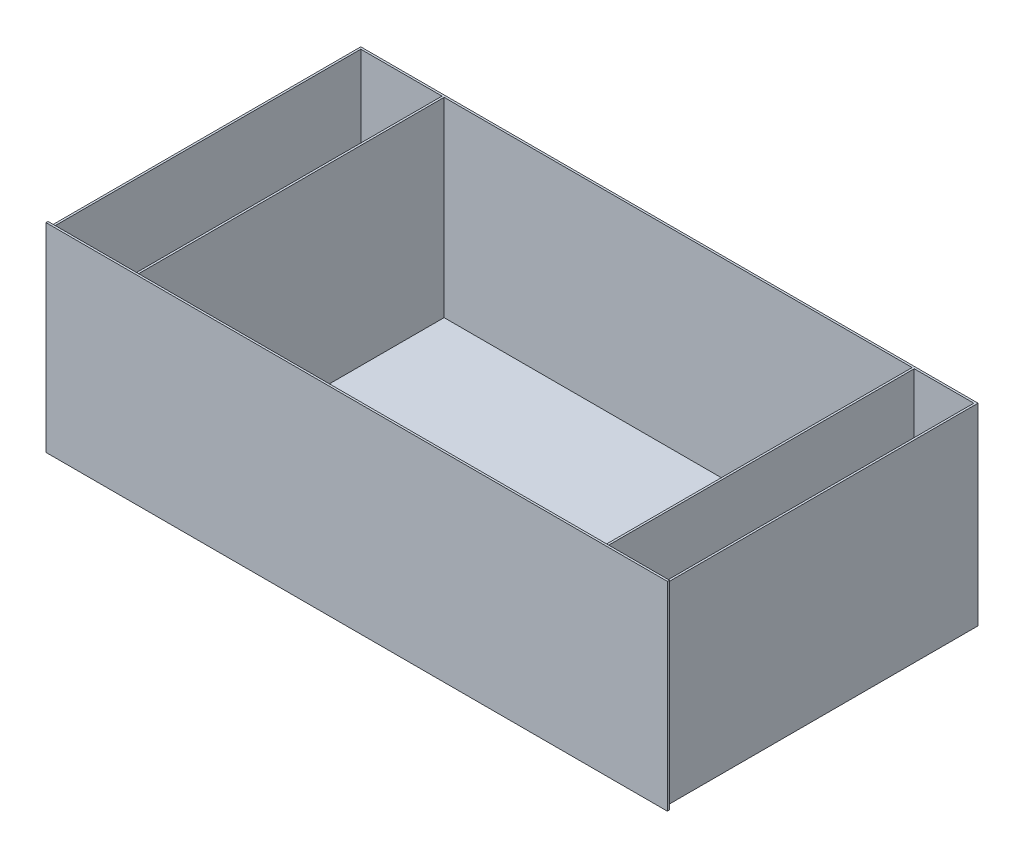
ISO-10303-21;
HEADER;
FILE_DESCRIPTION(('STEP AP214'),'2;1');
FILE_NAME('part.step','',(''),(''),'','','');
FILE_SCHEMA(('AUTOMOTIVE_DESIGN { 1 0 10303 214 1 1 1 1 }'));
ENDSEC;
DATA;
#1=APPLICATION_CONTEXT('core data for automotive mechanical design processes');
#2=APPLICATION_PROTOCOL_DEFINITION('international standard','automotive_design',2000,#1);
#3=PRODUCT_CONTEXT('',#1,'mechanical');
#4=PRODUCT('Part','Part','',(#3));
#5=PRODUCT_RELATED_PRODUCT_CATEGORY('part','',(#4));
#6=PRODUCT_DEFINITION_FORMATION('','',#4);
#7=PRODUCT_DEFINITION_CONTEXT('part definition',#1,'design');
#8=PRODUCT_DEFINITION('design','',#6,#7);
#9=PRODUCT_DEFINITION_SHAPE('','',#8);
#10=(LENGTH_UNIT() NAMED_UNIT(*) SI_UNIT(.MILLI.,.METRE.));
#11=(NAMED_UNIT(*) PLANE_ANGLE_UNIT() SI_UNIT($,.RADIAN.));
#12=(NAMED_UNIT(*) SI_UNIT($,.STERADIAN.) SOLID_ANGLE_UNIT());
#13=UNCERTAINTY_MEASURE_WITH_UNIT(LENGTH_MEASURE(1.E-05),#10,'distance_accuracy_value','');
#14=(GEOMETRIC_REPRESENTATION_CONTEXT(3) GLOBAL_UNCERTAINTY_ASSIGNED_CONTEXT((#13)) GLOBAL_UNIT_ASSIGNED_CONTEXT((#10,
#11,#12)) REPRESENTATION_CONTEXT('',''));
#15=CARTESIAN_POINT('',(0.,0.,0.));
#16=DIRECTION('',(0.,0.,1.));
#17=DIRECTION('',(1.,0.,0.));
#18=AXIS2_PLACEMENT_3D('',#15,#16,#17);
#19=CARTESIAN_POINT('',(604.,193.5,4.));
#20=DIRECTION('',(-1.,0.,0.));
#21=DIRECTION('',(0.,-1.,0.));
#22=AXIS2_PLACEMENT_3D('',#19,#20,#21);
#23=PLANE('',#22);
#24=DIRECTION('',(0.,1.,0.));
#25=VECTOR('',#24,1.);
#26=CARTESIAN_POINT('',(604.,193.5,0.));
#27=LINE('',#26,#25);
#28=CARTESIAN_POINT('',(604.,-193.5,0.));
#29=VERTEX_POINT('',#28);
#30=CARTESIAN_POINT('',(604.,193.5,0.));
#31=VERTEX_POINT('',#30);
#32=EDGE_CURVE('E303',#29,#31,#27,.T.);
#33=ORIENTED_EDGE('',*,*,#32,.T.);
#34=DIRECTION('',(0.,0.,-1.));
#35=VECTOR('',#34,1.);
#36=CARTESIAN_POINT('',(604.,193.5,4.));
#37=LINE('',#36,#35);
#38=CARTESIAN_POINT('',(604.,193.5,4.));
#39=VERTEX_POINT('',#38);
#40=EDGE_CURVE('E11',#39,#31,#37,.T.);
#41=ORIENTED_EDGE('',*,*,#40,.F.);
#42=DIRECTION('',(0.,1.,0.));
#43=VECTOR('',#42,1.);
#44=CARTESIAN_POINT('',(604.,193.5,4.));
#45=LINE('',#44,#43);
#46=CARTESIAN_POINT('',(604.,-193.5,4.));
#47=VERTEX_POINT('',#46);
#48=EDGE_CURVE('E304',#47,#39,#45,.T.);
#49=ORIENTED_EDGE('',*,*,#48,.F.);
#50=DIRECTION('',(0.,0.,-1.));
#51=VECTOR('',#50,1.);
#52=CARTESIAN_POINT('',(604.,-193.5,4.));
#53=LINE('',#52,#51);
#54=EDGE_CURVE('E314',#47,#29,#53,.T.);
#55=ORIENTED_EDGE('',*,*,#54,.T.);
#56=EDGE_LOOP('',(#33,#41,#49,#55));
#57=FACE_BOUND('',#56,.T.);
#58=ADVANCED_FACE('F36',(#57),#23,.F.);
#59=CARTESIAN_POINT('',(-604.,193.5,4.));
#60=DIRECTION('',(0.,-1.,0.));
#61=DIRECTION('',(0.,0.,-1.));
#62=AXIS2_PLACEMENT_3D('',#59,#60,#61);
#63=PLANE('',#62);
#64=DIRECTION('',(-1.,0.,0.));
#65=VECTOR('',#64,1.);
#66=CARTESIAN_POINT('',(-604.,193.5,0.));
#67=LINE('',#66,#65);
#68=CARTESIAN_POINT('',(-604.,193.5,0.));
#69=VERTEX_POINT('',#68);
#70=EDGE_CURVE('E317',#31,#69,#67,.T.);
#71=ORIENTED_EDGE('',*,*,#70,.T.);
#72=DIRECTION('',(0.,0.,-1.));
#73=VECTOR('',#72,1.);
#74=CARTESIAN_POINT('',(-604.,193.5,4.));
#75=LINE('',#74,#73);
#76=CARTESIAN_POINT('',(-604.,193.5,4.));
#77=VERTEX_POINT('',#76);
#78=EDGE_CURVE('E43',#77,#69,#75,.T.);
#79=ORIENTED_EDGE('',*,*,#78,.F.);
#80=DIRECTION('',(-1.,0.,0.));
#81=VECTOR('',#80,1.);
#82=CARTESIAN_POINT('',(-604.,193.5,4.));
#83=LINE('',#82,#81);
#84=EDGE_CURVE('E307',#39,#77,#83,.T.);
#85=ORIENTED_EDGE('',*,*,#84,.F.);
#86=ORIENTED_EDGE('',*,*,#40,.T.);
#87=EDGE_LOOP('',(#71,#79,#85,#86));
#88=FACE_BOUND('',#87,.T.);
#89=ADVANCED_FACE('F347',(#88),#63,.F.);
#90=CARTESIAN_POINT('',(-604.,193.5,4.));
#91=DIRECTION('',(1.,0.,0.));
#92=DIRECTION('',(0.,1.,0.));
#93=AXIS2_PLACEMENT_3D('',#90,#91,#92);
#94=PLANE('',#93);
#95=DIRECTION('',(0.,-1.,0.));
#96=VECTOR('',#95,1.);
#97=CARTESIAN_POINT('',(-604.,193.5,0.));
#98=LINE('',#97,#96);
#99=CARTESIAN_POINT('',(-604.000000000001,-193.5,0.));
#100=VERTEX_POINT('',#99);
#101=EDGE_CURVE('E319',#69,#100,#98,.T.);
#102=ORIENTED_EDGE('',*,*,#101,.T.);
#103=DIRECTION('',(0.,0.,-1.));
#104=VECTOR('',#103,1.);
#105=CARTESIAN_POINT('',(-604.000000000001,-193.5,4.));
#106=LINE('',#105,#104);
#107=CARTESIAN_POINT('',(-604.000000000001,-193.5,4.));
#108=VERTEX_POINT('',#107);
#109=EDGE_CURVE('E324',#108,#100,#106,.T.);
#110=ORIENTED_EDGE('',*,*,#109,.F.);
#111=DIRECTION('',(0.,-1.,0.));
#112=VECTOR('',#111,1.);
#113=CARTESIAN_POINT('',(-604.,193.5,4.));
#114=LINE('',#113,#112);
#115=EDGE_CURVE('E310',#77,#108,#114,.T.);
#116=ORIENTED_EDGE('',*,*,#115,.F.);
#117=ORIENTED_EDGE('',*,*,#78,.T.);
#118=EDGE_LOOP('',(#102,#110,#116,#117));
#119=FACE_BOUND('',#118,.T.);
#120=ADVANCED_FACE('F331',(#119),#94,.F.);
#121=CARTESIAN_POINT('',(-604.000000000001,-193.5,4.));
#122=DIRECTION('',(0.,1.,0.));
#123=DIRECTION('',(0.,0.,1.));
#124=AXIS2_PLACEMENT_3D('',#121,#122,#123);
#125=PLANE('',#124);
#126=DIRECTION('',(1.,0.,0.));
#127=VECTOR('',#126,1.);
#128=CARTESIAN_POINT('',(-604.000000000001,-193.5,0.));
#129=LINE('',#128,#127);
#130=EDGE_CURVE('E308',#100,#29,#129,.T.);
#131=ORIENTED_EDGE('',*,*,#130,.T.);
#132=ORIENTED_EDGE('',*,*,#54,.F.);
#133=DIRECTION('',(1.,0.,0.));
#134=VECTOR('',#133,1.);
#135=CARTESIAN_POINT('',(-604.000000000001,-193.5,4.));
#136=LINE('',#135,#134);
#137=EDGE_CURVE('E312',#108,#47,#136,.T.);
#138=ORIENTED_EDGE('',*,*,#137,.F.);
#139=ORIENTED_EDGE('',*,*,#109,.T.);
#140=EDGE_LOOP('',(#131,#132,#138,#139));
#141=FACE_BOUND('',#140,.T.);
#142=ADVANCED_FACE('F340',(#141),#125,.F.);
#143=CARTESIAN_POINT('',(0.,0.,4.));
#144=DIRECTION('',(0.,0.,1.));
#145=DIRECTION('',(1.,0.,0.));
#146=AXIS2_PLACEMENT_3D('',#143,#144,#145);
#147=PLANE('',#146);
#148=ORIENTED_EDGE('',*,*,#48,.T.);
#149=ORIENTED_EDGE('',*,*,#84,.T.);
#150=ORIENTED_EDGE('',*,*,#115,.T.);
#151=ORIENTED_EDGE('',*,*,#137,.T.);
#152=EDGE_LOOP('',(#148,#149,#150,#151));
#153=FACE_BOUND('',#152,.T.);
#154=ADVANCED_FACE('F346',(#153),#147,.T.);
#155=CARTESIAN_POINT('',(0.,0.,0.));
#156=DIRECTION('',(0.,0.,1.));
#157=DIRECTION('',(1.,0.,0.));
#158=AXIS2_PLACEMENT_3D('',#155,#156,#157);
#159=PLANE('',#158);
#160=DIRECTION('',(0.,-1.,0.));
#161=VECTOR('',#160,1.);
#162=CARTESIAN_POINT('',(-600.,187.5,0.));
#163=LINE('',#162,#161);
#164=CARTESIAN_POINT('',(-600.,187.5,0.));
#165=VERTEX_POINT('',#164);
#166=CARTESIAN_POINT('',(-600.,-187.5,0.));
#167=VERTEX_POINT('',#166);
#168=EDGE_CURVE('E297',#165,#167,#163,.T.);
#169=ORIENTED_EDGE('',*,*,#168,.T.);
#170=DIRECTION('',(1.,0.,0.));
#171=VECTOR('',#170,1.);
#172=CARTESIAN_POINT('',(-600.,-187.5,0.));
#173=LINE('',#172,#171);
#174=CARTESIAN_POINT('',(600.,-187.5,-3.62637039397257E-13));
#175=VERTEX_POINT('',#174);
#176=EDGE_CURVE('E289',#167,#175,#173,.T.);
#177=ORIENTED_EDGE('',*,*,#176,.T.);
#178=DIRECTION('',(0.,-1.,0.));
#179=VECTOR('',#178,1.);
#180=CARTESIAN_POINT('',(600.,187.5,-3.62637039397257E-13));
#181=LINE('',#180,#179);
#182=CARTESIAN_POINT('',(600.,187.5,-3.62637039397257E-13));
#183=VERTEX_POINT('',#182);
#184=EDGE_CURVE('E295',#183,#175,#181,.T.);
#185=ORIENTED_EDGE('',*,*,#184,.F.);
#186=DIRECTION('',(1.,0.,0.));
#187=VECTOR('',#186,1.);
#188=CARTESIAN_POINT('',(-600.,187.5,0.));
#189=LINE('',#188,#187);
#190=EDGE_CURVE('E279',#165,#183,#189,.T.);
#191=ORIENTED_EDGE('',*,*,#190,.F.);
#192=EDGE_LOOP('',(#169,#177,#185,#191));
#193=FACE_BOUND('',#192,.T.);
#194=ORIENTED_EDGE('',*,*,#32,.F.);
#195=ORIENTED_EDGE('',*,*,#130,.F.);
#196=ORIENTED_EDGE('',*,*,#101,.F.);
#197=ORIENTED_EDGE('',*,*,#70,.F.);
#198=EDGE_LOOP('',(#194,#195,#196,#197));
#199=FACE_BOUND('',#198,.T.);
#200=ADVANCED_FACE('F337',(#193,#199),#159,.F.);
#201=CARTESIAN_POINT('',(600.,187.5,-604.));
#202=DIRECTION('',(0.,0.,1.));
#203=DIRECTION('',(1.,0.,0.));
#204=AXIS2_PLACEMENT_3D('',#201,#202,#203);
#205=PLANE('',#204);
#206=DIRECTION('',(-1.,0.,0.));
#207=VECTOR('',#206,1.);
#208=CARTESIAN_POINT('',(600.,-187.5,-604.));
#209=LINE('',#208,#207);
#210=CARTESIAN_POINT('',(600.,-187.5,-604.));
#211=VERTEX_POINT('',#210);
#212=CARTESIAN_POINT('',(-600.,-187.5,-604.));
#213=VERTEX_POINT('',#212);
#214=EDGE_CURVE('E208',#211,#213,#209,.T.);
#215=ORIENTED_EDGE('',*,*,#214,.T.);
#216=DIRECTION('',(0.,-1.,0.));
#217=VECTOR('',#216,1.);
#218=CARTESIAN_POINT('',(-600.,187.5,-604.));
#219=LINE('',#218,#217);
#220=CARTESIAN_POINT('',(-600.,187.5,-604.));
#221=VERTEX_POINT('',#220);
#222=EDGE_CURVE('E300',#221,#213,#219,.T.);
#223=ORIENTED_EDGE('',*,*,#222,.F.);
#224=DIRECTION('',(-1.,0.,0.));
#225=VECTOR('',#224,1.);
#226=CARTESIAN_POINT('',(600.,187.5,-604.));
#227=LINE('',#226,#225);
#228=CARTESIAN_POINT('',(600.,187.5,-604.));
#229=VERTEX_POINT('',#228);
#230=EDGE_CURVE('E273',#229,#221,#227,.T.);
#231=ORIENTED_EDGE('',*,*,#230,.F.);
#232=DIRECTION('',(0.,-1.,0.));
#233=VECTOR('',#232,1.);
#234=CARTESIAN_POINT('',(600.,187.5,-604.));
#235=LINE('',#234,#233);
#236=EDGE_CURVE('E283',#229,#211,#235,.T.);
#237=ORIENTED_EDGE('',*,*,#236,.T.);
#238=EDGE_LOOP('',(#215,#223,#231,#237));
#239=FACE_BOUND('',#238,.T.);
#240=ADVANCED_FACE('F359',(#239),#205,.F.);
#241=CARTESIAN_POINT('',(-600.,187.5,-604.));
#242=DIRECTION('',(1.,0.,0.));
#243=DIRECTION('',(0.,0.,-1.));
#244=AXIS2_PLACEMENT_3D('',#241,#242,#243);
#245=PLANE('',#244);
#246=DIRECTION('',(0.,0.,1.));
#247=VECTOR('',#246,1.);
#248=CARTESIAN_POINT('',(-600.,-187.5,-604.));
#249=LINE('',#248,#247);
#250=EDGE_CURVE('E286',#213,#167,#249,.T.);
#251=ORIENTED_EDGE('',*,*,#250,.T.);
#252=ORIENTED_EDGE('',*,*,#168,.F.);
#253=DIRECTION('',(0.,0.,1.));
#254=VECTOR('',#253,1.);
#255=CARTESIAN_POINT('',(-600.,187.5,-604.));
#256=LINE('',#255,#254);
#257=EDGE_CURVE('E276',#221,#165,#256,.T.);
#258=ORIENTED_EDGE('',*,*,#257,.F.);
#259=ORIENTED_EDGE('',*,*,#222,.T.);
#260=EDGE_LOOP('',(#251,#252,#258,#259));
#261=FACE_BOUND('',#260,.T.);
#262=ADVANCED_FACE('F365',(#261),#245,.F.);
#263=CARTESIAN_POINT('',(600.,187.5,-3.62637039397257E-13));
#264=DIRECTION('',(-1.,0.,0.));
#265=DIRECTION('',(0.,0.,1.));
#266=AXIS2_PLACEMENT_3D('',#263,#264,#265);
#267=PLANE('',#266);
#268=DIRECTION('',(0.,0.,-1.));
#269=VECTOR('',#268,1.);
#270=CARTESIAN_POINT('',(600.,-187.5,-3.62637039397257E-13));
#271=LINE('',#270,#269);
#272=EDGE_CURVE('E277',#175,#211,#271,.T.);
#273=ORIENTED_EDGE('',*,*,#272,.T.);
#274=ORIENTED_EDGE('',*,*,#236,.F.);
#275=DIRECTION('',(0.,0.,-1.));
#276=VECTOR('',#275,1.);
#277=CARTESIAN_POINT('',(600.,187.5,-3.62637039397257E-13));
#278=LINE('',#277,#276);
#279=EDGE_CURVE('E281',#183,#229,#278,.T.);
#280=ORIENTED_EDGE('',*,*,#279,.F.);
#281=ORIENTED_EDGE('',*,*,#184,.T.);
#282=EDGE_LOOP('',(#273,#274,#280,#281));
#283=FACE_BOUND('',#282,.T.);
#284=ADVANCED_FACE('F369',(#283),#267,.F.);
#285=CARTESIAN_POINT('',(0.,187.5,0.));
#286=DIRECTION('',(0.,1.,0.));
#287=DIRECTION('',(0.,0.,1.));
#288=AXIS2_PLACEMENT_3D('',#285,#286,#287);
#289=PLANE('',#288);
#290=DIRECTION('',(-1.,0.,0.));
#291=VECTOR('',#290,1.);
#292=CARTESIAN_POINT('',(-438.,187.5,-600.));
#293=LINE('',#292,#291);
#294=CARTESIAN_POINT('',(-438.,187.5,-600.));
#295=VERTEX_POINT('',#294);
#296=CARTESIAN_POINT('',(-596.,187.5,-600.));
#297=VERTEX_POINT('',#296);
#298=EDGE_CURVE('E50',#295,#297,#293,.T.);
#299=ORIENTED_EDGE('',*,*,#298,.F.);
#300=DIRECTION('',(0.,0.,-1.));
#301=VECTOR('',#300,1.);
#302=CARTESIAN_POINT('',(-438.,187.5,-4.00000000000011));
#303=LINE('',#302,#301);
#304=CARTESIAN_POINT('',(-438.,187.5,-4.00000000000011));
#305=VERTEX_POINT('',#304);
#306=EDGE_CURVE('E192',#305,#295,#303,.T.);
#307=ORIENTED_EDGE('',*,*,#306,.F.);
#308=DIRECTION('',(1.,0.,0.));
#309=VECTOR('',#308,1.);
#310=CARTESIAN_POINT('',(-596.,187.5,-4.00000000000011));
#311=LINE('',#310,#309);
#312=CARTESIAN_POINT('',(-596.,187.5,-4.00000000000011));
#313=VERTEX_POINT('',#312);
#314=EDGE_CURVE('E195',#313,#305,#311,.T.);
#315=ORIENTED_EDGE('',*,*,#314,.F.);
#316=DIRECTION('',(0.,0.,1.));
#317=VECTOR('',#316,1.);
#318=CARTESIAN_POINT('',(-596.,187.5,-600.));
#319=LINE('',#318,#317);
#320=EDGE_CURVE('E201',#297,#313,#319,.T.);
#321=ORIENTED_EDGE('',*,*,#320,.F.);
#322=EDGE_LOOP('',(#299,#307,#315,#321));
#323=FACE_BOUND('',#322,.T.);
#324=DIRECTION('',(0.,0.,1.));
#325=VECTOR('',#324,1.);
#326=CARTESIAN_POINT('',(-434.,187.5,-4.));
#327=LINE('',#326,#325);
#328=CARTESIAN_POINT('',(-434.,187.5,-600.));
#329=VERTEX_POINT('',#328);
#330=CARTESIAN_POINT('',(-434.,187.5,-4.));
#331=VERTEX_POINT('',#330);
#332=EDGE_CURVE('E58',#329,#331,#327,.T.);
#333=ORIENTED_EDGE('',*,*,#332,.F.);
#334=DIRECTION('',(-1.,0.,0.));
#335=VECTOR('',#334,1.);
#336=CARTESIAN_POINT('',(-434.,187.5,-600.));
#337=LINE('',#336,#335);
#338=CARTESIAN_POINT('',(476.,187.5,-600.));
#339=VERTEX_POINT('',#338);
#340=EDGE_CURVE('E216',#339,#329,#337,.T.);
#341=ORIENTED_EDGE('',*,*,#340,.F.);
#342=DIRECTION('',(0.,0.,-1.));
#343=VECTOR('',#342,1.);
#344=CARTESIAN_POINT('',(476.,187.5,-600.));
#345=LINE('',#344,#343);
#346=CARTESIAN_POINT('',(476.,187.5,-4.00000000000011));
#347=VERTEX_POINT('',#346);
#348=EDGE_CURVE('E231',#347,#339,#345,.T.);
#349=ORIENTED_EDGE('',*,*,#348,.F.);
#350=DIRECTION('',(1.,0.,0.));
#351=VECTOR('',#350,1.);
#352=CARTESIAN_POINT('',(476.,187.5,-4.00000000000011));
#353=LINE('',#352,#351);
#354=EDGE_CURVE('E227',#331,#347,#353,.T.);
#355=ORIENTED_EDGE('',*,*,#354,.F.);
#356=EDGE_LOOP('',(#333,#341,#349,#355));
#357=FACE_BOUND('',#356,.T.);
#358=DIRECTION('',(0.,0.,1.));
#359=VECTOR('',#358,1.);
#360=CARTESIAN_POINT('',(480.,187.5,-4.00000000000011));
#361=LINE('',#360,#359);
#362=CARTESIAN_POINT('',(480.,187.5,-600.));
#363=VERTEX_POINT('',#362);
#364=CARTESIAN_POINT('',(480.,187.5,-4.00000000000011));
#365=VERTEX_POINT('',#364);
#366=EDGE_CURVE('E256',#363,#365,#361,.T.);
#367=ORIENTED_EDGE('',*,*,#366,.F.);
#368=DIRECTION('',(-1.,0.,0.));
#369=VECTOR('',#368,1.);
#370=CARTESIAN_POINT('',(480.,187.5,-600.));
#371=LINE('',#370,#369);
#372=CARTESIAN_POINT('',(596.,187.5,-600.));
#373=VERTEX_POINT('',#372);
#374=EDGE_CURVE('E246',#373,#363,#371,.T.);
#375=ORIENTED_EDGE('',*,*,#374,.F.);
#376=DIRECTION('',(0.,0.,-1.));
#377=VECTOR('',#376,1.);
#378=CARTESIAN_POINT('',(596.,187.5,-600.));
#379=LINE('',#378,#377);
#380=CARTESIAN_POINT('',(596.,187.5,-4.00000000000011));
#381=VERTEX_POINT('',#380);
#382=EDGE_CURVE('E261',#381,#373,#379,.T.);
#383=ORIENTED_EDGE('',*,*,#382,.F.);
#384=DIRECTION('',(1.,0.,0.));
#385=VECTOR('',#384,1.);
#386=CARTESIAN_POINT('',(596.,187.5,-4.00000000000011));
#387=LINE('',#386,#385);
#388=EDGE_CURVE('E258',#365,#381,#387,.T.);
#389=ORIENTED_EDGE('',*,*,#388,.F.);
#390=EDGE_LOOP('',(#367,#375,#383,#389));
#391=FACE_BOUND('',#390,.T.);
#392=ORIENTED_EDGE('',*,*,#230,.T.);
#393=ORIENTED_EDGE('',*,*,#257,.T.);
#394=ORIENTED_EDGE('',*,*,#190,.T.);
#395=ORIENTED_EDGE('',*,*,#279,.T.);
#396=EDGE_LOOP('',(#392,#393,#394,#395));
#397=FACE_BOUND('',#396,.T.);
#398=ADVANCED_FACE('F373',(#323,#357,#391,#397),#289,.T.);
#399=CARTESIAN_POINT('',(0.,-187.5,0.));
#400=DIRECTION('',(0.,1.,0.));
#401=DIRECTION('',(0.,0.,1.));
#402=AXIS2_PLACEMENT_3D('',#399,#400,#401);
#403=PLANE('',#402);
#404=ORIENTED_EDGE('',*,*,#214,.F.);
#405=ORIENTED_EDGE('',*,*,#272,.F.);
#406=ORIENTED_EDGE('',*,*,#176,.F.);
#407=ORIENTED_EDGE('',*,*,#250,.F.);
#408=EDGE_LOOP('',(#404,#405,#406,#407));
#409=FACE_BOUND('',#408,.T.);
#410=ADVANCED_FACE('F375',(#409),#403,.F.);
#411=CARTESIAN_POINT('',(480.,-183.5,-4.00000000000011));
#412=DIRECTION('',(-1.,0.,0.));
#413=DIRECTION('',(0.,0.,1.));
#414=AXIS2_PLACEMENT_3D('',#411,#412,#413);
#415=PLANE('',#414);
#416=ORIENTED_EDGE('',*,*,#366,.T.);
#417=DIRECTION('',(0.,1.,0.));
#418=VECTOR('',#417,1.);
#419=CARTESIAN_POINT('',(480.,-183.5,-4.00000000000011));
#420=LINE('',#419,#418);
#421=CARTESIAN_POINT('',(480.,-183.5,-4.00000000000011));
#422=VERTEX_POINT('',#421);
#423=EDGE_CURVE('E255',#422,#365,#420,.T.);
#424=ORIENTED_EDGE('',*,*,#423,.F.);
#425=DIRECTION('',(0.,0.,1.));
#426=VECTOR('',#425,1.);
#427=CARTESIAN_POINT('',(480.,-183.5,-4.00000000000011));
#428=LINE('',#427,#426);
#429=CARTESIAN_POINT('',(480.,-183.5,-600.));
#430=VERTEX_POINT('',#429);
#431=EDGE_CURVE('E242',#430,#422,#428,.T.);
#432=ORIENTED_EDGE('',*,*,#431,.F.);
#433=DIRECTION('',(0.,1.,0.));
#434=VECTOR('',#433,1.);
#435=CARTESIAN_POINT('',(480.,-183.5,-600.));
#436=LINE('',#435,#434);
#437=EDGE_CURVE('E228',#430,#363,#436,.T.);
#438=ORIENTED_EDGE('',*,*,#437,.T.);
#439=EDGE_LOOP('',(#416,#424,#432,#438));
#440=FACE_BOUND('',#439,.T.);
#441=ADVANCED_FACE('F378',(#440),#415,.F.);
#442=CARTESIAN_POINT('',(480.,-183.5,-600.));
#443=DIRECTION('',(0.,0.,-1.));
#444=DIRECTION('',(-1.,0.,0.));
#445=AXIS2_PLACEMENT_3D('',#442,#443,#444);
#446=PLANE('',#445);
#447=ORIENTED_EDGE('',*,*,#374,.T.);
#448=ORIENTED_EDGE('',*,*,#437,.F.);
#449=DIRECTION('',(-1.,0.,0.));
#450=VECTOR('',#449,1.);
#451=CARTESIAN_POINT('',(480.,-183.5,-600.));
#452=LINE('',#451,#450);
#453=CARTESIAN_POINT('',(596.,-183.5,-600.));
#454=VERTEX_POINT('',#453);
#455=EDGE_CURVE('E252',#454,#430,#452,.T.);
#456=ORIENTED_EDGE('',*,*,#455,.F.);
#457=DIRECTION('',(0.,1.,0.));
#458=VECTOR('',#457,1.);
#459=CARTESIAN_POINT('',(596.,-183.5,-600.));
#460=LINE('',#459,#458);
#461=EDGE_CURVE('E267',#454,#373,#460,.T.);
#462=ORIENTED_EDGE('',*,*,#461,.T.);
#463=EDGE_LOOP('',(#447,#448,#456,#462));
#464=FACE_BOUND('',#463,.T.);
#465=ADVANCED_FACE('F385',(#464),#446,.F.);
#466=CARTESIAN_POINT('',(596.,-183.5,-600.));
#467=DIRECTION('',(1.,0.,0.));
#468=DIRECTION('',(0.,0.,-1.));
#469=AXIS2_PLACEMENT_3D('',#466,#467,#468);
#470=PLANE('',#469);
#471=ORIENTED_EDGE('',*,*,#382,.T.);
#472=ORIENTED_EDGE('',*,*,#461,.F.);
#473=DIRECTION('',(0.,0.,-1.));
#474=VECTOR('',#473,1.);
#475=CARTESIAN_POINT('',(596.,-183.5,-600.));
#476=LINE('',#475,#474);
#477=CARTESIAN_POINT('',(596.,-183.5,-4.00000000000011));
#478=VERTEX_POINT('',#477);
#479=EDGE_CURVE('E249',#478,#454,#476,.T.);
#480=ORIENTED_EDGE('',*,*,#479,.F.);
#481=DIRECTION('',(0.,1.,0.));
#482=VECTOR('',#481,1.);
#483=CARTESIAN_POINT('',(596.,-183.5,-4.00000000000011));
#484=LINE('',#483,#482);
#485=EDGE_CURVE('E269',#478,#381,#484,.T.);
#486=ORIENTED_EDGE('',*,*,#485,.T.);
#487=EDGE_LOOP('',(#471,#472,#480,#486));
#488=FACE_BOUND('',#487,.T.);
#489=ADVANCED_FACE('F391',(#488),#470,.F.);
#490=CARTESIAN_POINT('',(596.,-183.5,-4.00000000000011));
#491=DIRECTION('',(0.,0.,1.));
#492=DIRECTION('',(1.,0.,0.));
#493=AXIS2_PLACEMENT_3D('',#490,#491,#492);
#494=PLANE('',#493);
#495=ORIENTED_EDGE('',*,*,#388,.T.);
#496=ORIENTED_EDGE('',*,*,#485,.F.);
#497=DIRECTION('',(1.,0.,0.));
#498=VECTOR('',#497,1.);
#499=CARTESIAN_POINT('',(596.,-183.5,-4.00000000000011));
#500=LINE('',#499,#498);
#501=EDGE_CURVE('E245',#422,#478,#500,.T.);
#502=ORIENTED_EDGE('',*,*,#501,.F.);
#503=ORIENTED_EDGE('',*,*,#423,.T.);
#504=EDGE_LOOP('',(#495,#496,#502,#503));
#505=FACE_BOUND('',#504,.T.);
#506=ADVANCED_FACE('F387',(#505),#494,.F.);
#507=CARTESIAN_POINT('',(0.,-183.5,0.));
#508=DIRECTION('',(0.,-1.,0.));
#509=DIRECTION('',(0.,0.,-1.));
#510=AXIS2_PLACEMENT_3D('',#507,#508,#509);
#511=PLANE('',#510);
#512=ORIENTED_EDGE('',*,*,#431,.T.);
#513=ORIENTED_EDGE('',*,*,#501,.T.);
#514=ORIENTED_EDGE('',*,*,#479,.T.);
#515=ORIENTED_EDGE('',*,*,#455,.T.);
#516=EDGE_LOOP('',(#512,#513,#514,#515));
#517=FACE_BOUND('',#516,.T.);
#518=ADVANCED_FACE('F390',(#517),#511,.F.);
#519=CARTESIAN_POINT('',(-434.,-183.5,-4.));
#520=DIRECTION('',(-1.,0.,0.));
#521=DIRECTION('',(0.,0.,1.));
#522=AXIS2_PLACEMENT_3D('',#519,#520,#521);
#523=PLANE('',#522);
#524=ORIENTED_EDGE('',*,*,#332,.T.);
#525=DIRECTION('',(0.,1.,0.));
#526=VECTOR('',#525,1.);
#527=CARTESIAN_POINT('',(-434.,-183.5,-4.));
#528=LINE('',#527,#526);
#529=CARTESIAN_POINT('',(-434.,-183.5,-4.));
#530=VERTEX_POINT('',#529);
#531=EDGE_CURVE('E225',#530,#331,#528,.T.);
#532=ORIENTED_EDGE('',*,*,#531,.F.);
#533=DIRECTION('',(0.,0.,1.));
#534=VECTOR('',#533,1.);
#535=CARTESIAN_POINT('',(-434.,-183.5,-4.));
#536=LINE('',#535,#534);
#537=CARTESIAN_POINT('',(-434.,-183.5,-600.));
#538=VERTEX_POINT('',#537);
#539=EDGE_CURVE('E212',#538,#530,#536,.T.);
#540=ORIENTED_EDGE('',*,*,#539,.F.);
#541=DIRECTION('',(0.,1.,0.));
#542=VECTOR('',#541,1.);
#543=CARTESIAN_POINT('',(-434.,-183.5,-600.));
#544=LINE('',#543,#542);
#545=EDGE_CURVE('E202',#538,#329,#544,.T.);
#546=ORIENTED_EDGE('',*,*,#545,.T.);
#547=EDGE_LOOP('',(#524,#532,#540,#546));
#548=FACE_BOUND('',#547,.T.);
#549=ADVANCED_FACE('F401',(#548),#523,.F.);
#550=CARTESIAN_POINT('',(-434.,-183.5,-600.));
#551=DIRECTION('',(0.,0.,-1.));
#552=DIRECTION('',(-1.,0.,0.));
#553=AXIS2_PLACEMENT_3D('',#550,#551,#552);
#554=PLANE('',#553);
#555=ORIENTED_EDGE('',*,*,#340,.T.);
#556=ORIENTED_EDGE('',*,*,#545,.F.);
#557=DIRECTION('',(-1.,0.,0.));
#558=VECTOR('',#557,1.);
#559=CARTESIAN_POINT('',(-434.,-183.5,-600.));
#560=LINE('',#559,#558);
#561=CARTESIAN_POINT('',(476.,-183.5,-600.));
#562=VERTEX_POINT('',#561);
#563=EDGE_CURVE('E222',#562,#538,#560,.T.);
#564=ORIENTED_EDGE('',*,*,#563,.F.);
#565=DIRECTION('',(0.,1.,0.));
#566=VECTOR('',#565,1.);
#567=CARTESIAN_POINT('',(476.,-183.5,-600.));
#568=LINE('',#567,#566);
#569=EDGE_CURVE('E237',#562,#339,#568,.T.);
#570=ORIENTED_EDGE('',*,*,#569,.T.);
#571=EDGE_LOOP('',(#555,#556,#564,#570));
#572=FACE_BOUND('',#571,.T.);
#573=ADVANCED_FACE('F405',(#572),#554,.F.);
#574=CARTESIAN_POINT('',(476.,-183.5,-600.));
#575=DIRECTION('',(1.,0.,0.));
#576=DIRECTION('',(0.,0.,-1.));
#577=AXIS2_PLACEMENT_3D('',#574,#575,#576);
#578=PLANE('',#577);
#579=ORIENTED_EDGE('',*,*,#348,.T.);
#580=ORIENTED_EDGE('',*,*,#569,.F.);
#581=DIRECTION('',(0.,0.,-1.));
#582=VECTOR('',#581,1.);
#583=CARTESIAN_POINT('',(476.,-183.5,-600.));
#584=LINE('',#583,#582);
#585=CARTESIAN_POINT('',(476.,-183.5,-4.00000000000011));
#586=VERTEX_POINT('',#585);
#587=EDGE_CURVE('E219',#586,#562,#584,.T.);
#588=ORIENTED_EDGE('',*,*,#587,.F.);
#589=DIRECTION('',(0.,1.,0.));
#590=VECTOR('',#589,1.);
#591=CARTESIAN_POINT('',(476.,-183.5,-4.00000000000011));
#592=LINE('',#591,#590);
#593=EDGE_CURVE('E239',#586,#347,#592,.T.);
#594=ORIENTED_EDGE('',*,*,#593,.T.);
#595=EDGE_LOOP('',(#579,#580,#588,#594));
#596=FACE_BOUND('',#595,.T.);
#597=ADVANCED_FACE('F410',(#596),#578,.F.);
#598=CARTESIAN_POINT('',(476.,-183.5,-4.00000000000011));
#599=DIRECTION('',(0.,0.,1.));
#600=DIRECTION('',(1.,0.,0.));
#601=AXIS2_PLACEMENT_3D('',#598,#599,#600);
#602=PLANE('',#601);
#603=ORIENTED_EDGE('',*,*,#354,.T.);
#604=ORIENTED_EDGE('',*,*,#593,.F.);
#605=DIRECTION('',(1.,0.,0.));
#606=VECTOR('',#605,1.);
#607=CARTESIAN_POINT('',(476.,-183.5,-4.00000000000011));
#608=LINE('',#607,#606);
#609=EDGE_CURVE('E215',#530,#586,#608,.T.);
#610=ORIENTED_EDGE('',*,*,#609,.F.);
#611=ORIENTED_EDGE('',*,*,#531,.T.);
#612=EDGE_LOOP('',(#603,#604,#610,#611));
#613=FACE_BOUND('',#612,.T.);
#614=ADVANCED_FACE('F406',(#613),#602,.F.);
#615=CARTESIAN_POINT('',(0.,-183.5,0.));
#616=DIRECTION('',(0.,-1.,0.));
#617=DIRECTION('',(0.,0.,-1.));
#618=AXIS2_PLACEMENT_3D('',#615,#616,#617);
#619=PLANE('',#618);
#620=ORIENTED_EDGE('',*,*,#539,.T.);
#621=ORIENTED_EDGE('',*,*,#609,.T.);
#622=ORIENTED_EDGE('',*,*,#587,.T.);
#623=ORIENTED_EDGE('',*,*,#563,.T.);
#624=EDGE_LOOP('',(#620,#621,#622,#623));
#625=FACE_BOUND('',#624,.T.);
#626=ADVANCED_FACE('F409',(#625),#619,.F.);
#627=CARTESIAN_POINT('',(-438.,-183.5,-600.));
#628=DIRECTION('',(0.,0.,-1.));
#629=DIRECTION('',(-1.,0.,0.));
#630=AXIS2_PLACEMENT_3D('',#627,#628,#629);
#631=PLANE('',#630);
#632=ORIENTED_EDGE('',*,*,#298,.T.);
#633=DIRECTION('',(0.,1.,0.));
#634=VECTOR('',#633,1.);
#635=CARTESIAN_POINT('',(-596.,-183.5,-600.));
#636=LINE('',#635,#634);
#637=CARTESIAN_POINT('',(-596.,-183.5,-600.));
#638=VERTEX_POINT('',#637);
#639=EDGE_CURVE('E170',#638,#297,#636,.T.);
#640=ORIENTED_EDGE('',*,*,#639,.F.);
#641=DIRECTION('',(-1.,0.,0.));
#642=VECTOR('',#641,1.);
#643=CARTESIAN_POINT('',(-438.,-183.5,-600.));
#644=LINE('',#643,#642);
#645=CARTESIAN_POINT('',(-438.,-183.5,-600.));
#646=VERTEX_POINT('',#645);
#647=EDGE_CURVE('E174',#646,#638,#644,.T.);
#648=ORIENTED_EDGE('',*,*,#647,.F.);
#649=DIRECTION('',(0.,1.,0.));
#650=VECTOR('',#649,1.);
#651=CARTESIAN_POINT('',(-438.,-183.5,-600.));
#652=LINE('',#651,#650);
#653=EDGE_CURVE('E206',#646,#295,#652,.T.);
#654=ORIENTED_EDGE('',*,*,#653,.T.);
#655=EDGE_LOOP('',(#632,#640,#648,#654));
#656=FACE_BOUND('',#655,.T.);
#657=ADVANCED_FACE('F172',(#656),#631,.F.);
#658=CARTESIAN_POINT('',(-438.,-183.5,-4.00000000000011));
#659=DIRECTION('',(1.,0.,0.));
#660=DIRECTION('',(0.,0.,-1.));
#661=AXIS2_PLACEMENT_3D('',#658,#659,#660);
#662=PLANE('',#661);
#663=ORIENTED_EDGE('',*,*,#306,.T.);
#664=ORIENTED_EDGE('',*,*,#653,.F.);
#665=DIRECTION('',(0.,0.,-1.));
#666=VECTOR('',#665,1.);
#667=CARTESIAN_POINT('',(-438.,-183.5,-4.00000000000011));
#668=LINE('',#667,#666);
#669=CARTESIAN_POINT('',(-438.,-183.5,-4.00000000000011));
#670=VERTEX_POINT('',#669);
#671=EDGE_CURVE('E180',#670,#646,#668,.T.);
#672=ORIENTED_EDGE('',*,*,#671,.F.);
#673=DIRECTION('',(0.,1.,0.));
#674=VECTOR('',#673,1.);
#675=CARTESIAN_POINT('',(-438.,-183.5,-4.00000000000011));
#676=LINE('',#675,#674);
#677=EDGE_CURVE('E209',#670,#305,#676,.T.);
#678=ORIENTED_EDGE('',*,*,#677,.T.);
#679=EDGE_LOOP('',(#663,#664,#672,#678));
#680=FACE_BOUND('',#679,.T.);
#681=ADVANCED_FACE('F423',(#680),#662,.F.);
#682=CARTESIAN_POINT('',(-596.,-183.5,-4.00000000000011));
#683=DIRECTION('',(0.,0.,1.));
#684=DIRECTION('',(1.,0.,0.));
#685=AXIS2_PLACEMENT_3D('',#682,#683,#684);
#686=PLANE('',#685);
#687=ORIENTED_EDGE('',*,*,#314,.T.);
#688=ORIENTED_EDGE('',*,*,#677,.F.);
#689=DIRECTION('',(1.,0.,0.));
#690=VECTOR('',#689,1.);
#691=CARTESIAN_POINT('',(-596.,-183.5,-4.00000000000011));
#692=LINE('',#691,#690);
#693=CARTESIAN_POINT('',(-596.,-183.5,-4.00000000000011));
#694=VERTEX_POINT('',#693);
#695=EDGE_CURVE('E188',#694,#670,#692,.T.);
#696=ORIENTED_EDGE('',*,*,#695,.F.);
#697=DIRECTION('',(0.,1.,0.));
#698=VECTOR('',#697,1.);
#699=CARTESIAN_POINT('',(-596.,-183.5,-4.00000000000011));
#700=LINE('',#699,#698);
#701=EDGE_CURVE('E179',#694,#313,#700,.T.);
#702=ORIENTED_EDGE('',*,*,#701,.T.);
#703=EDGE_LOOP('',(#687,#688,#696,#702));
#704=FACE_BOUND('',#703,.T.);
#705=ADVANCED_FACE('F426',(#704),#686,.F.);
#706=CARTESIAN_POINT('',(-596.,-183.5,-600.));
#707=DIRECTION('',(-1.,0.,0.));
#708=DIRECTION('',(0.,0.,1.));
#709=AXIS2_PLACEMENT_3D('',#706,#707,#708);
#710=PLANE('',#709);
#711=ORIENTED_EDGE('',*,*,#320,.T.);
#712=ORIENTED_EDGE('',*,*,#701,.F.);
#713=DIRECTION('',(0.,0.,1.));
#714=VECTOR('',#713,1.);
#715=CARTESIAN_POINT('',(-596.,-183.5,-600.));
#716=LINE('',#715,#714);
#717=EDGE_CURVE('E183',#638,#694,#716,.T.);
#718=ORIENTED_EDGE('',*,*,#717,.F.);
#719=ORIENTED_EDGE('',*,*,#639,.T.);
#720=EDGE_LOOP('',(#711,#712,#718,#719));
#721=FACE_BOUND('',#720,.T.);
#722=ADVANCED_FACE('F184',(#721),#710,.F.);
#723=CARTESIAN_POINT('',(0.,-183.5,0.));
#724=DIRECTION('',(0.,1.,0.));
#725=DIRECTION('',(0.,0.,1.));
#726=AXIS2_PLACEMENT_3D('',#723,#724,#725);
#727=PLANE('',#726);
#728=ORIENTED_EDGE('',*,*,#647,.T.);
#729=ORIENTED_EDGE('',*,*,#717,.T.);
#730=ORIENTED_EDGE('',*,*,#695,.T.);
#731=ORIENTED_EDGE('',*,*,#671,.T.);
#732=EDGE_LOOP('',(#728,#729,#730,#731));
#733=FACE_BOUND('',#732,.T.);
#734=ADVANCED_FACE('F190',(#733),#727,.T.);
#735=CLOSED_SHELL('',(#58,#89,#120,#142,#154,#200,#240,#262,#284,#398,#410,#441,#465,#489,#506,
#518,#549,#573,#597,#614,#626,#657,#681,#705,#722,#734));
#736=MANIFOLD_SOLID_BREP('B2',#735);
#737=ADVANCED_BREP_SHAPE_REPRESENTATION('',(#18,#736),#14);
#738=SHAPE_DEFINITION_REPRESENTATION(#9,#737);
ENDSEC;
END-ISO-10303-21;
